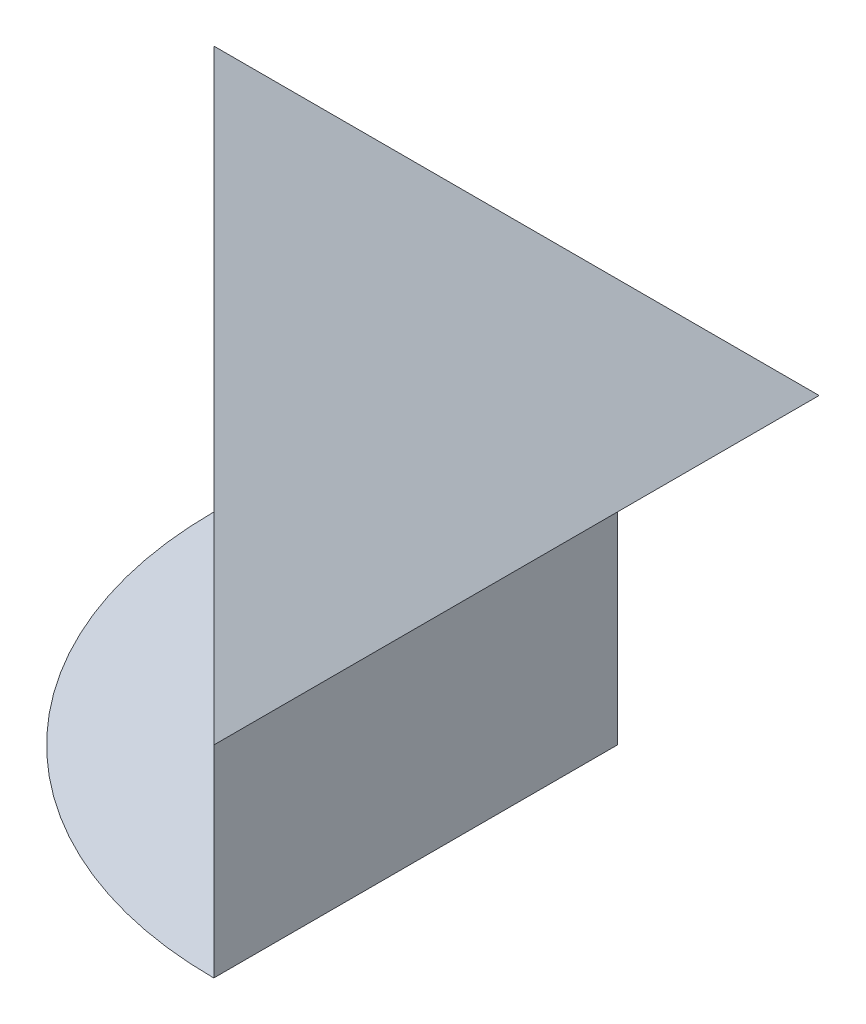
ISO-10303-21;
HEADER;
FILE_DESCRIPTION(('STEP AP214'),'2;1');
FILE_NAME('part.step','',(''),(''),'','','');
FILE_SCHEMA(('AUTOMOTIVE_DESIGN { 1 0 10303 214 1 1 1 1 }'));
ENDSEC;
DATA;
#1=APPLICATION_CONTEXT('core data for automotive mechanical design processes');
#2=APPLICATION_PROTOCOL_DEFINITION('international standard','automotive_design',2000,#1);
#3=PRODUCT_CONTEXT('',#1,'mechanical');
#4=PRODUCT('Part','Part','',(#3));
#5=PRODUCT_RELATED_PRODUCT_CATEGORY('part','',(#4));
#6=PRODUCT_DEFINITION_FORMATION('','',#4);
#7=PRODUCT_DEFINITION_CONTEXT('part definition',#1,'design');
#8=PRODUCT_DEFINITION('design','',#6,#7);
#9=PRODUCT_DEFINITION_SHAPE('','',#8);
#10=(LENGTH_UNIT() NAMED_UNIT(*) SI_UNIT(.MILLI.,.METRE.));
#11=(NAMED_UNIT(*) PLANE_ANGLE_UNIT() SI_UNIT($,.RADIAN.));
#12=(NAMED_UNIT(*) SI_UNIT($,.STERADIAN.) SOLID_ANGLE_UNIT());
#13=UNCERTAINTY_MEASURE_WITH_UNIT(LENGTH_MEASURE(1.E-05),#10,'distance_accuracy_value','');
#14=(GEOMETRIC_REPRESENTATION_CONTEXT(3) GLOBAL_UNCERTAINTY_ASSIGNED_CONTEXT((#13)) GLOBAL_UNIT_ASSIGNED_CONTEXT((#10,
#11,#12)) REPRESENTATION_CONTEXT('',''));
#15=CARTESIAN_POINT('',(0.,0.,0.));
#16=DIRECTION('',(0.,0.,1.));
#17=DIRECTION('',(1.,0.,0.));
#18=AXIS2_PLACEMENT_3D('',#15,#16,#17);
#19=CARTESIAN_POINT('',(-5.,0.,5.));
#20=DIRECTION('',(0.707106781186547,0.,-0.707106781186547));
#21=DIRECTION('',(-0.707106781186548,0.,-0.707106781186548));
#22=AXIS2_PLACEMENT_3D('',#19,#20,#21);
#23=PLANE('',#22);
#24=DIRECTION('',(-0.707106781186548,0.,-0.707106781186548));
#25=VECTOR('',#24,1.);
#26=CARTESIAN_POINT('',(-5.,0.0001,5.));
#27=LINE('',#26,#25);
#28=CARTESIAN_POINT('',(40.,0.0001,50.));
#29=VERTEX_POINT('',#28);
#30=CARTESIAN_POINT('',(0.,0.0001,10.));
#31=VERTEX_POINT('',#30);
#32=EDGE_CURVE('E12',#29,#31,#27,.T.);
#33=ORIENTED_EDGE('',*,*,#32,.F.);
#34=DIRECTION('',(0.,-1.,0.));
#35=VECTOR('',#34,1.);
#36=CARTESIAN_POINT('',(40.,0.,50.));
#37=LINE('',#36,#35);
#38=CARTESIAN_POINT('',(40.,30.,50.));
#39=VERTEX_POINT('',#38);
#40=EDGE_CURVE('E148',#39,#29,#37,.T.);
#41=ORIENTED_EDGE('',*,*,#40,.F.);
#42=DIRECTION('',(0.707106781186548,0.,0.707106781186548));
#43=VECTOR('',#42,1.);
#44=CARTESIAN_POINT('',(25.,30.,35.));
#45=LINE('',#44,#43);
#46=CARTESIAN_POINT('',(50.,30.,60.));
#47=VERTEX_POINT('',#46);
#48=EDGE_CURVE('E141',#39,#47,#45,.T.);
#49=ORIENTED_EDGE('',*,*,#48,.T.);
#50=DIRECTION('',(0.577350269189626,-0.577350269189626,0.577350269189626));
#51=VECTOR('',#50,1.);
#52=CARTESIAN_POINT('',(43.3333333333333,36.6666666666667,53.3333333333333));
#53=LINE('',#52,#51);
#54=CARTESIAN_POINT('',(20.,60.,30.));
#55=VERTEX_POINT('',#54);
#56=EDGE_CURVE('E171',#55,#47,#53,.T.);
#57=ORIENTED_EDGE('',*,*,#56,.F.);
#58=DIRECTION('',(-0.577350269189626,-0.577350269189626,-0.577350269189626));
#59=VECTOR('',#58,1.);
#60=CARTESIAN_POINT('',(3.33333333333333,43.3333333333333,13.3333333333333));
#61=LINE('',#60,#59);
#62=CARTESIAN_POINT('',(-10.,30.,0.));
#63=VERTEX_POINT('',#62);
#64=EDGE_CURVE('E162',#55,#63,#61,.T.);
#65=ORIENTED_EDGE('',*,*,#64,.T.);
#66=CARTESIAN_POINT('',(0.,30.,10.));
#67=VERTEX_POINT('',#66);
#68=EDGE_CURVE('E175',#63,#67,#45,.T.);
#69=ORIENTED_EDGE('',*,*,#68,.T.);
#70=DIRECTION('',(0.,1.,0.));
#71=VECTOR('',#70,1.);
#72=CARTESIAN_POINT('',(0.,0.,10.));
#73=LINE('',#72,#71);
#74=EDGE_CURVE('E151',#31,#67,#73,.T.);
#75=ORIENTED_EDGE('',*,*,#74,.F.);
#76=EDGE_LOOP('',(#33,#41,#49,#57,#65,#69,#75));
#77=FACE_BOUND('',#76,.T.);
#78=ADVANCED_FACE('F75',(#77),#23,.F.);
#79=CARTESIAN_POINT('',(40.,40.,60.));
#80=DIRECTION('',(-0.707106781186547,-0.707106781186548,0.));
#81=DIRECTION('',(0.707106781186548,-0.707106781186547,0.));
#82=AXIS2_PLACEMENT_3D('',#79,#80,#81);
#83=PLANE('',#82);
#84=DIRECTION('',(-0.577350269189626,0.577350269189626,0.577350269189626));
#85=VECTOR('',#84,1.);
#86=CARTESIAN_POINT('',(23.3333333333333,56.6666666666667,26.6666666666667));
#87=LINE('',#86,#85);
#88=CARTESIAN_POINT('',(50.,30.,0.));
#89=VERTEX_POINT('',#88);
#90=EDGE_CURVE('E158',#89,#55,#87,.T.);
#91=ORIENTED_EDGE('',*,*,#90,.T.);
#92=ORIENTED_EDGE('',*,*,#56,.T.);
#93=DIRECTION('',(0.,0.,-1.));
#94=VECTOR('',#93,1.);
#95=CARTESIAN_POINT('',(50.,30.,60.));
#96=LINE('',#95,#94);
#97=EDGE_CURVE('E90',#47,#89,#96,.T.);
#98=ORIENTED_EDGE('',*,*,#97,.T.);
#99=EDGE_LOOP('',(#91,#92,#98));
#100=FACE_BOUND('',#99,.T.);
#101=ADVANCED_FACE('F77',(#100),#83,.F.);
#102=CARTESIAN_POINT('',(0.,0.,60.));
#103=DIRECTION('',(0.,1.,0.));
#104=DIRECTION('',(0.,0.,1.));
#105=AXIS2_PLACEMENT_3D('',#102,#103,#104);
#106=PLANE('',#105);
#107=DIRECTION('',(0.,0.,-1.));
#108=VECTOR('',#107,1.);
#109=CARTESIAN_POINT('',(40.,0.,60.));
#110=LINE('',#109,#108);
#111=CARTESIAN_POINT('',(40.,0.,50.));
#112=VERTEX_POINT('',#111);
#113=CARTESIAN_POINT('',(40.,0.,10.));
#114=VERTEX_POINT('',#113);
#115=EDGE_CURVE('E83',#112,#114,#110,.T.);
#116=ORIENTED_EDGE('',*,*,#115,.F.);
#117=CARTESIAN_POINT('',(40.,0.,10.));
#118=DIRECTION('',(0.,-1.,0.));
#119=DIRECTION('',(0.,0.,-1.));
#120=AXIS2_PLACEMENT_3D('',#117,#118,#119);
#121=CIRCLE('',#120,40.);
#122=CARTESIAN_POINT('',(0.,0.,10.));
#123=VERTEX_POINT('',#122);
#124=EDGE_CURVE('E136',#112,#123,#121,.T.);
#125=ORIENTED_EDGE('',*,*,#124,.T.);
#126=DIRECTION('',(-1.,0.,0.));
#127=VECTOR('',#126,1.);
#128=CARTESIAN_POINT('',(60.,0.,10.));
#129=LINE('',#128,#127);
#130=EDGE_CURVE('E169',#114,#123,#129,.T.);
#131=ORIENTED_EDGE('',*,*,#130,.F.);
#132=EDGE_LOOP('',(#116,#125,#131));
#133=FACE_BOUND('',#132,.T.);
#134=ADVANCED_FACE('F168',(#133),#106,.F.);
#135=CARTESIAN_POINT('',(40.,0.,60.));
#136=DIRECTION('',(-1.,0.,0.));
#137=DIRECTION('',(0.,0.,1.));
#138=AXIS2_PLACEMENT_3D('',#135,#136,#137);
#139=PLANE('',#138);
#140=DIRECTION('',(0.,1.,0.));
#141=VECTOR('',#140,1.);
#142=CARTESIAN_POINT('',(40.,0.,10.));
#143=LINE('',#142,#141);
#144=CARTESIAN_POINT('',(40.,30.,10.));
#145=VERTEX_POINT('',#144);
#146=EDGE_CURVE('E98',#114,#145,#143,.T.);
#147=ORIENTED_EDGE('',*,*,#146,.T.);
#148=DIRECTION('',(0.,0.,-1.));
#149=VECTOR('',#148,1.);
#150=CARTESIAN_POINT('',(40.,30.,60.));
#151=LINE('',#150,#149);
#152=EDGE_CURVE('E156',#39,#145,#151,.T.);
#153=ORIENTED_EDGE('',*,*,#152,.F.);
#154=ORIENTED_EDGE('',*,*,#40,.T.);
#155=DIRECTION('',(0.,-1.,0.));
#156=VECTOR('',#155,1.);
#157=CARTESIAN_POINT('',(40.,0.0001,50.));
#158=LINE('',#157,#156);
#159=EDGE_CURVE('E130',#29,#112,#158,.T.);
#160=ORIENTED_EDGE('',*,*,#159,.T.);
#161=ORIENTED_EDGE('',*,*,#115,.T.);
#162=EDGE_LOOP('',(#147,#153,#154,#160,#161));
#163=FACE_BOUND('',#162,.T.);
#164=ADVANCED_FACE('F154',(#163),#139,.F.);
#165=CARTESIAN_POINT('',(0.,30.,60.));
#166=DIRECTION('',(0.,-1.,0.));
#167=DIRECTION('',(1.,0.,0.));
#168=AXIS2_PLACEMENT_3D('',#165,#166,#167);
#169=PLANE('',#168);
#170=ORIENTED_EDGE('',*,*,#68,.F.);
#171=DIRECTION('',(-1.,0.,0.));
#172=VECTOR('',#171,1.);
#173=CARTESIAN_POINT('',(0.,30.,0.));
#174=LINE('',#173,#172);
#175=EDGE_CURVE('E157',#89,#63,#174,.T.);
#176=ORIENTED_EDGE('',*,*,#175,.F.);
#177=ORIENTED_EDGE('',*,*,#97,.F.);
#178=ORIENTED_EDGE('',*,*,#48,.F.);
#179=ORIENTED_EDGE('',*,*,#152,.T.);
#180=DIRECTION('',(-1.,0.,0.));
#181=VECTOR('',#180,1.);
#182=CARTESIAN_POINT('',(60.,30.,10.));
#183=LINE('',#182,#181);
#184=EDGE_CURVE('E170',#145,#67,#183,.T.);
#185=ORIENTED_EDGE('',*,*,#184,.T.);
#186=EDGE_LOOP('',(#170,#176,#177,#178,#179,#185));
#187=FACE_BOUND('',#186,.T.);
#188=ADVANCED_FACE('F185',(#187),#169,.T.);
#189=CARTESIAN_POINT('',(60.,15.,-15.));
#190=DIRECTION('',(0.,-0.707106781186547,0.707106781186547));
#191=DIRECTION('',(0.,-0.707106781186548,-0.707106781186548));
#192=AXIS2_PLACEMENT_3D('',#189,#190,#191);
#193=PLANE('',#192);
#194=ORIENTED_EDGE('',*,*,#175,.T.);
#195=ORIENTED_EDGE('',*,*,#64,.F.);
#196=ORIENTED_EDGE('',*,*,#90,.F.);
#197=EDGE_LOOP('',(#194,#195,#196));
#198=FACE_BOUND('',#197,.T.);
#199=ADVANCED_FACE('F187',(#198),#193,.F.);
#200=CARTESIAN_POINT('',(60.,0.,10.));
#201=DIRECTION('',(0.,0.,1.));
#202=DIRECTION('',(1.,0.,0.));
#203=AXIS2_PLACEMENT_3D('',#200,#201,#202);
#204=PLANE('',#203);
#205=EDGE_CURVE('E178',#123,#31,#73,.T.);
#206=ORIENTED_EDGE('',*,*,#205,.T.);
#207=ORIENTED_EDGE('',*,*,#74,.T.);
#208=ORIENTED_EDGE('',*,*,#184,.F.);
#209=ORIENTED_EDGE('',*,*,#146,.F.);
#210=ORIENTED_EDGE('',*,*,#130,.T.);
#211=EDGE_LOOP('',(#206,#207,#208,#209,#210));
#212=FACE_BOUND('',#211,.T.);
#213=ADVANCED_FACE('F200',(#212),#204,.F.);
#214=CARTESIAN_POINT('',(40.,0.0001,10.));
#215=DIRECTION('',(0.,-1.,0.));
#216=DIRECTION('',(0.,0.,-1.));
#217=AXIS2_PLACEMENT_3D('',#214,#215,#216);
#218=PLANE('',#217);
#219=CARTESIAN_POINT('',(40.,0.0001,10.));
#220=DIRECTION('',(0.,-1.,0.));
#221=DIRECTION('',(0.,0.,-1.));
#222=AXIS2_PLACEMENT_3D('',#219,#220,#221);
#223=CIRCLE('',#222,40.);
#224=EDGE_CURVE('E134',#29,#31,#223,.T.);
#225=ORIENTED_EDGE('',*,*,#224,.F.);
#226=ORIENTED_EDGE('',*,*,#32,.T.);
#227=EDGE_LOOP('',(#225,#226));
#228=FACE_BOUND('',#227,.T.);
#229=ADVANCED_FACE('F145',(#228),#218,.F.);
#230=CARTESIAN_POINT('',(40.,0.0001,10.));
#231=DIRECTION('',(0.,-1.,0.));
#232=DIRECTION('',(0.,0.,-1.));
#233=AXIS2_PLACEMENT_3D('',#230,#231,#232);
#234=CYLINDRICAL_SURFACE('',#233,40.);
#235=ORIENTED_EDGE('',*,*,#124,.F.);
#236=ORIENTED_EDGE('',*,*,#159,.F.);
#237=ORIENTED_EDGE('',*,*,#224,.T.);
#238=ORIENTED_EDGE('',*,*,#205,.F.);
#239=EDGE_LOOP('',(#235,#236,#237,#238));
#240=FACE_BOUND('',#239,.T.);
#241=ADVANCED_FACE('F132',(#240),#234,.T.);
#242=CLOSED_SHELL('',(#78,#101,#134,#164,#188,#199,#213,#229,#241));
#243=MANIFOLD_SOLID_BREP('B2',#242);
#244=ADVANCED_BREP_SHAPE_REPRESENTATION('',(#18,#243),#14);
#245=SHAPE_DEFINITION_REPRESENTATION(#9,#244);
ENDSEC;
END-ISO-10303-21;
